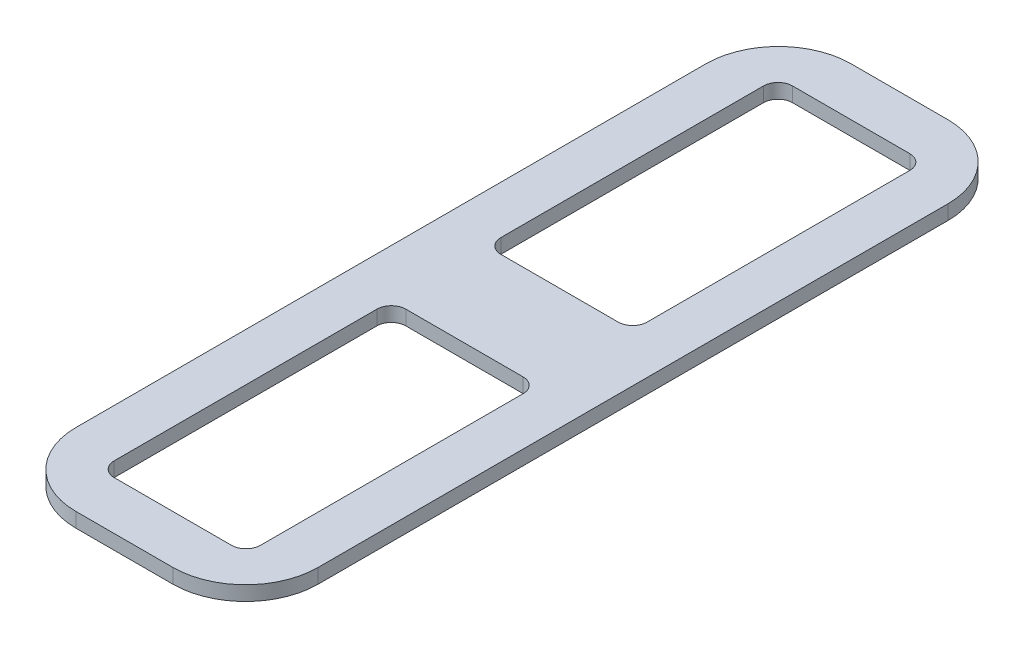
ISO-10303-21;
HEADER;
FILE_DESCRIPTION(('STEP AP214'),'2;1');
FILE_NAME('part.step','',(''),(''),'','','');
FILE_SCHEMA(('AUTOMOTIVE_DESIGN { 1 0 10303 214 1 1 1 1 }'));
ENDSEC;
DATA;
#1=APPLICATION_CONTEXT('core data for automotive mechanical design processes');
#2=APPLICATION_PROTOCOL_DEFINITION('international standard','automotive_design',2000,#1);
#3=PRODUCT_CONTEXT('',#1,'mechanical');
#4=PRODUCT('Part','Part','',(#3));
#5=PRODUCT_RELATED_PRODUCT_CATEGORY('part','',(#4));
#6=PRODUCT_DEFINITION_FORMATION('','',#4);
#7=PRODUCT_DEFINITION_CONTEXT('part definition',#1,'design');
#8=PRODUCT_DEFINITION('design','',#6,#7);
#9=PRODUCT_DEFINITION_SHAPE('','',#8);
#10=(LENGTH_UNIT() NAMED_UNIT(*) SI_UNIT(.MILLI.,.METRE.));
#11=(NAMED_UNIT(*) PLANE_ANGLE_UNIT() SI_UNIT($,.RADIAN.));
#12=(NAMED_UNIT(*) SI_UNIT($,.STERADIAN.) SOLID_ANGLE_UNIT());
#13=UNCERTAINTY_MEASURE_WITH_UNIT(LENGTH_MEASURE(1.E-05),#10,'distance_accuracy_value','');
#14=(GEOMETRIC_REPRESENTATION_CONTEXT(3) GLOBAL_UNCERTAINTY_ASSIGNED_CONTEXT((#13)) GLOBAL_UNIT_ASSIGNED_CONTEXT((#10,
#11,#12)) REPRESENTATION_CONTEXT('',''));
#15=CARTESIAN_POINT('',(0.,0.,0.));
#16=DIRECTION('',(0.,0.,1.));
#17=DIRECTION('',(1.,0.,0.));
#18=AXIS2_PLACEMENT_3D('',#15,#16,#17);
#19=CARTESIAN_POINT('',(0.,3.,0.));
#20=DIRECTION('',(0.,1.,0.));
#21=DIRECTION('',(0.,0.,1.));
#22=AXIS2_PLACEMENT_3D('',#19,#20,#21);
#23=PLANE('',#22);
#24=CARTESIAN_POINT('',(-12.1,3.,-67.));
#25=DIRECTION('',(0.,1.,0.));
#26=DIRECTION('',(0.,0.,1.));
#27=AXIS2_PLACEMENT_3D('',#24,#25,#26);
#28=CIRCLE('',#27,2.99999999999999);
#29=CARTESIAN_POINT('',(-12.1,3.,-70.));
#30=VERTEX_POINT('',#29);
#31=CARTESIAN_POINT('',(-15.1,3.,-67.));
#32=VERTEX_POINT('',#31);
#33=EDGE_CURVE('E277',#30,#32,#28,.T.);
#34=ORIENTED_EDGE('',*,*,#33,.F.);
#35=DIRECTION('',(1.,0.,0.));
#36=VECTOR('',#35,1.);
#37=CARTESIAN_POINT('',(-12.1,3.,-70.));
#38=LINE('',#37,#36);
#39=CARTESIAN_POINT('',(12.1,3.,-70.));
#40=VERTEX_POINT('',#39);
#41=EDGE_CURVE('E300',#30,#40,#38,.T.);
#42=ORIENTED_EDGE('',*,*,#41,.T.);
#43=CARTESIAN_POINT('',(12.1,3.,-67.));
#44=DIRECTION('',(0.,-1.,0.));
#45=DIRECTION('',(0.,0.,-1.));
#46=AXIS2_PLACEMENT_3D('',#43,#44,#45);
#47=CIRCLE('',#46,2.99999999999999);
#48=CARTESIAN_POINT('',(15.1,3.,-67.));
#49=VERTEX_POINT('',#48);
#50=EDGE_CURVE('E348',#40,#49,#47,.T.);
#51=ORIENTED_EDGE('',*,*,#50,.T.);
#52=DIRECTION('',(0.,0.,1.));
#53=VECTOR('',#52,1.);
#54=CARTESIAN_POINT('',(15.1,3.,-67.));
#55=LINE('',#54,#53);
#56=CARTESIAN_POINT('',(15.1,3.,-12.8));
#57=VERTEX_POINT('',#56);
#58=EDGE_CURVE('E344',#49,#57,#55,.T.);
#59=ORIENTED_EDGE('',*,*,#58,.T.);
#60=CARTESIAN_POINT('',(12.1,3.,-12.8));
#61=DIRECTION('',(0.,1.,0.));
#62=DIRECTION('',(0.,0.,1.));
#63=AXIS2_PLACEMENT_3D('',#60,#61,#62);
#64=CIRCLE('',#63,3.);
#65=CARTESIAN_POINT('',(12.1,3.,-9.8));
#66=VERTEX_POINT('',#65);
#67=EDGE_CURVE('E340',#66,#57,#64,.T.);
#68=ORIENTED_EDGE('',*,*,#67,.F.);
#69=DIRECTION('',(1.,0.,0.));
#70=VECTOR('',#69,1.);
#71=CARTESIAN_POINT('',(-12.1,3.,-9.8));
#72=LINE('',#71,#70);
#73=CARTESIAN_POINT('',(-12.1,3.,-9.8));
#74=VERTEX_POINT('',#73);
#75=EDGE_CURVE('E336',#74,#66,#72,.T.);
#76=ORIENTED_EDGE('',*,*,#75,.F.);
#77=CARTESIAN_POINT('',(-12.1,3.,-12.8));
#78=DIRECTION('',(0.,1.,0.));
#79=DIRECTION('',(0.,0.,1.));
#80=AXIS2_PLACEMENT_3D('',#77,#78,#79);
#81=CIRCLE('',#80,3.);
#82=CARTESIAN_POINT('',(-15.1,3.,-12.8));
#83=VERTEX_POINT('',#82);
#84=EDGE_CURVE('E332',#83,#74,#81,.T.);
#85=ORIENTED_EDGE('',*,*,#84,.F.);
#86=DIRECTION('',(0.,0.,1.));
#87=VECTOR('',#86,1.);
#88=CARTESIAN_POINT('',(-15.1,3.,-67.));
#89=LINE('',#88,#87);
#90=EDGE_CURVE('E328',#32,#83,#89,.T.);
#91=ORIENTED_EDGE('',*,*,#90,.F.);
#92=EDGE_LOOP('',(#34,#42,#51,#59,#68,#76,#85,#91));
#93=FACE_BOUND('',#92,.T.);
#94=DIRECTION('',(1.,0.,0.));
#95=VECTOR('',#94,1.);
#96=CARTESIAN_POINT('',(-25.,3.,80.));
#97=LINE('',#96,#95);
#98=CARTESIAN_POINT('',(-10.,3.,80.));
#99=VERTEX_POINT('',#98);
#100=CARTESIAN_POINT('',(9.99999999999999,3.,80.));
#101=VERTEX_POINT('',#100);
#102=EDGE_CURVE('E393',#99,#101,#97,.T.);
#103=ORIENTED_EDGE('',*,*,#102,.T.);
#104=CARTESIAN_POINT('',(10.,3.,65.));
#105=DIRECTION('',(0.,1.,0.));
#106=DIRECTION('',(0.,0.,1.));
#107=AXIS2_PLACEMENT_3D('',#104,#105,#106);
#108=CIRCLE('',#107,15.);
#109=CARTESIAN_POINT('',(25.,3.,65.));
#110=VERTEX_POINT('',#109);
#111=EDGE_CURVE('E446',#101,#110,#108,.T.);
#112=ORIENTED_EDGE('',*,*,#111,.T.);
#113=DIRECTION('',(0.,0.,-1.));
#114=VECTOR('',#113,1.);
#115=CARTESIAN_POINT('',(25.,3.,-80.));
#116=LINE('',#115,#114);
#117=CARTESIAN_POINT('',(25.,3.,-65.));
#118=VERTEX_POINT('',#117);
#119=EDGE_CURVE('E380',#110,#118,#116,.T.);
#120=ORIENTED_EDGE('',*,*,#119,.T.);
#121=CARTESIAN_POINT('',(9.99999999999999,3.,-65.));
#122=DIRECTION('',(0.,1.,0.));
#123=DIRECTION('',(0.,0.,1.));
#124=AXIS2_PLACEMENT_3D('',#121,#122,#123);
#125=CIRCLE('',#124,15.);
#126=CARTESIAN_POINT('',(9.99999999999999,3.,-80.));
#127=VERTEX_POINT('',#126);
#128=EDGE_CURVE('E440',#118,#127,#125,.T.);
#129=ORIENTED_EDGE('',*,*,#128,.T.);
#130=DIRECTION('',(-1.,0.,0.));
#131=VECTOR('',#130,1.);
#132=CARTESIAN_POINT('',(-25.,3.,-80.));
#133=LINE('',#132,#131);
#134=CARTESIAN_POINT('',(-10.,3.,-80.));
#135=VERTEX_POINT('',#134);
#136=EDGE_CURVE('E384',#127,#135,#133,.T.);
#137=ORIENTED_EDGE('',*,*,#136,.T.);
#138=CARTESIAN_POINT('',(-10.,3.,-65.));
#139=DIRECTION('',(0.,1.,0.));
#140=DIRECTION('',(0.,0.,1.));
#141=AXIS2_PLACEMENT_3D('',#138,#139,#140);
#142=CIRCLE('',#141,15.);
#143=CARTESIAN_POINT('',(-25.,3.,-65.));
#144=VERTEX_POINT('',#143);
#145=EDGE_CURVE('E437',#135,#144,#142,.T.);
#146=ORIENTED_EDGE('',*,*,#145,.T.);
#147=DIRECTION('',(0.,0.,1.));
#148=VECTOR('',#147,1.);
#149=CARTESIAN_POINT('',(-25.,3.,-80.));
#150=LINE('',#149,#148);
#151=CARTESIAN_POINT('',(-25.,3.,65.));
#152=VERTEX_POINT('',#151);
#153=EDGE_CURVE('E389',#144,#152,#150,.T.);
#154=ORIENTED_EDGE('',*,*,#153,.T.);
#155=CARTESIAN_POINT('',(-9.99999999999999,3.,65.));
#156=DIRECTION('',(0.,1.,0.));
#157=DIRECTION('',(0.,0.,1.));
#158=AXIS2_PLACEMENT_3D('',#155,#156,#157);
#159=CIRCLE('',#158,15.);
#160=EDGE_CURVE('E443',#152,#99,#159,.T.);
#161=ORIENTED_EDGE('',*,*,#160,.T.);
#162=EDGE_LOOP('',(#103,#112,#120,#129,#137,#146,#154,#161));
#163=FACE_BOUND('',#162,.T.);
#164=DIRECTION('',(1.,0.,0.));
#165=VECTOR('',#164,1.);
#166=CARTESIAN_POINT('',(-12.1,3.,70.));
#167=LINE('',#166,#165);
#168=CARTESIAN_POINT('',(-12.1,3.,70.));
#169=VERTEX_POINT('',#168);
#170=CARTESIAN_POINT('',(12.1,3.,70.));
#171=VERTEX_POINT('',#170);
#172=EDGE_CURVE('E252',#169,#171,#167,.T.);
#173=ORIENTED_EDGE('',*,*,#172,.F.);
#174=CARTESIAN_POINT('',(-12.1,3.,67.));
#175=DIRECTION('',(0.,-1.,0.));
#176=DIRECTION('',(0.,0.,-1.));
#177=AXIS2_PLACEMENT_3D('',#174,#175,#176);
#178=CIRCLE('',#177,2.99999999999999);
#179=CARTESIAN_POINT('',(-15.1,3.,67.));
#180=VERTEX_POINT('',#179);
#181=EDGE_CURVE('E59',#169,#180,#178,.T.);
#182=ORIENTED_EDGE('',*,*,#181,.T.);
#183=DIRECTION('',(0.,0.,-1.));
#184=VECTOR('',#183,1.);
#185=CARTESIAN_POINT('',(-15.1,3.,67.));
#186=LINE('',#185,#184);
#187=CARTESIAN_POINT('',(-15.1,3.,12.8));
#188=VERTEX_POINT('',#187);
#189=EDGE_CURVE('E226',#180,#188,#186,.T.);
#190=ORIENTED_EDGE('',*,*,#189,.T.);
#191=CARTESIAN_POINT('',(-12.1,3.,12.8));
#192=DIRECTION('',(0.,-1.,0.));
#193=DIRECTION('',(0.,0.,-1.));
#194=AXIS2_PLACEMENT_3D('',#191,#192,#193);
#195=CIRCLE('',#194,3.);
#196=CARTESIAN_POINT('',(-12.1,3.,9.8));
#197=VERTEX_POINT('',#196);
#198=EDGE_CURVE('E230',#188,#197,#195,.T.);
#199=ORIENTED_EDGE('',*,*,#198,.T.);
#200=DIRECTION('',(1.,0.,0.));
#201=VECTOR('',#200,1.);
#202=CARTESIAN_POINT('',(-12.1,3.,9.8));
#203=LINE('',#202,#201);
#204=CARTESIAN_POINT('',(12.1,3.,9.8));
#205=VERTEX_POINT('',#204);
#206=EDGE_CURVE('E267',#197,#205,#203,.T.);
#207=ORIENTED_EDGE('',*,*,#206,.T.);
#208=CARTESIAN_POINT('',(12.1,3.,12.8));
#209=DIRECTION('',(0.,-1.,0.));
#210=DIRECTION('',(0.,0.,-1.));
#211=AXIS2_PLACEMENT_3D('',#208,#209,#210);
#212=CIRCLE('',#211,3.);
#213=CARTESIAN_POINT('',(15.1,3.,12.8));
#214=VERTEX_POINT('',#213);
#215=EDGE_CURVE('E263',#205,#214,#212,.T.);
#216=ORIENTED_EDGE('',*,*,#215,.T.);
#217=DIRECTION('',(0.,0.,-1.));
#218=VECTOR('',#217,1.);
#219=CARTESIAN_POINT('',(15.1,3.,67.));
#220=LINE('',#219,#218);
#221=CARTESIAN_POINT('',(15.1,3.,67.));
#222=VERTEX_POINT('',#221);
#223=EDGE_CURVE('E259',#222,#214,#220,.T.);
#224=ORIENTED_EDGE('',*,*,#223,.F.);
#225=CARTESIAN_POINT('',(12.1,3.,67.));
#226=DIRECTION('',(0.,1.,0.));
#227=DIRECTION('',(0.,0.,1.));
#228=AXIS2_PLACEMENT_3D('',#225,#226,#227);
#229=CIRCLE('',#228,2.99999999999999);
#230=EDGE_CURVE('E255',#171,#222,#229,.T.);
#231=ORIENTED_EDGE('',*,*,#230,.F.);
#232=EDGE_LOOP('',(#173,#182,#190,#199,#207,#216,#224,#231));
#233=FACE_BOUND('',#232,.T.);
#234=ADVANCED_FACE('F43',(#93,#163,#233),#23,.T.);
#235=CARTESIAN_POINT('',(0.,0.,0.));
#236=DIRECTION('',(0.,1.,0.));
#237=DIRECTION('',(0.,0.,1.));
#238=AXIS2_PLACEMENT_3D('',#235,#236,#237);
#239=PLANE('',#238);
#240=DIRECTION('',(0.,0.,-1.));
#241=VECTOR('',#240,1.);
#242=CARTESIAN_POINT('',(25.,0.,-80.));
#243=LINE('',#242,#241);
#244=CARTESIAN_POINT('',(25.,0.,65.));
#245=VERTEX_POINT('',#244);
#246=CARTESIAN_POINT('',(25.,0.,-65.));
#247=VERTEX_POINT('',#246);
#248=EDGE_CURVE('E358',#245,#247,#243,.T.);
#249=ORIENTED_EDGE('',*,*,#248,.F.);
#250=CARTESIAN_POINT('',(10.,0.,65.));
#251=DIRECTION('',(0.,1.,0.));
#252=DIRECTION('',(0.,0.,1.));
#253=AXIS2_PLACEMENT_3D('',#250,#251,#252);
#254=CIRCLE('',#253,15.);
#255=CARTESIAN_POINT('',(9.99999999999999,0.,80.));
#256=VERTEX_POINT('',#255);
#257=EDGE_CURVE('E427',#245,#256,#254,.F.);
#258=ORIENTED_EDGE('',*,*,#257,.T.);
#259=DIRECTION('',(1.,0.,0.));
#260=VECTOR('',#259,1.);
#261=CARTESIAN_POINT('',(-25.,0.,80.));
#262=LINE('',#261,#260);
#263=CARTESIAN_POINT('',(-10.,0.,80.));
#264=VERTEX_POINT('',#263);
#265=EDGE_CURVE('E385',#264,#256,#262,.T.);
#266=ORIENTED_EDGE('',*,*,#265,.F.);
#267=CARTESIAN_POINT('',(-9.99999999999999,0.,65.));
#268=DIRECTION('',(0.,1.,0.));
#269=DIRECTION('',(0.,0.,1.));
#270=AXIS2_PLACEMENT_3D('',#267,#268,#269);
#271=CIRCLE('',#270,15.);
#272=CARTESIAN_POINT('',(-25.,0.,65.));
#273=VERTEX_POINT('',#272);
#274=EDGE_CURVE('E424',#264,#273,#271,.F.);
#275=ORIENTED_EDGE('',*,*,#274,.T.);
#276=DIRECTION('',(0.,0.,1.));
#277=VECTOR('',#276,1.);
#278=CARTESIAN_POINT('',(-25.,0.,-80.));
#279=LINE('',#278,#277);
#280=CARTESIAN_POINT('',(-25.,0.,-65.));
#281=VERTEX_POINT('',#280);
#282=EDGE_CURVE('E405',#281,#273,#279,.T.);
#283=ORIENTED_EDGE('',*,*,#282,.F.);
#284=CARTESIAN_POINT('',(-10.,0.,-65.));
#285=DIRECTION('',(0.,1.,0.));
#286=DIRECTION('',(0.,0.,1.));
#287=AXIS2_PLACEMENT_3D('',#284,#285,#286);
#288=CIRCLE('',#287,15.);
#289=CARTESIAN_POINT('',(-10.,0.,-80.));
#290=VERTEX_POINT('',#289);
#291=EDGE_CURVE('E418',#281,#290,#288,.F.);
#292=ORIENTED_EDGE('',*,*,#291,.T.);
#293=DIRECTION('',(-1.,0.,0.));
#294=VECTOR('',#293,1.);
#295=CARTESIAN_POINT('',(-25.,0.,-80.));
#296=LINE('',#295,#294);
#297=CARTESIAN_POINT('',(9.99999999999999,0.,-80.));
#298=VERTEX_POINT('',#297);
#299=EDGE_CURVE('E401',#298,#290,#296,.T.);
#300=ORIENTED_EDGE('',*,*,#299,.F.);
#301=CARTESIAN_POINT('',(9.99999999999999,0.,-65.));
#302=DIRECTION('',(0.,1.,0.));
#303=DIRECTION('',(0.,0.,1.));
#304=AXIS2_PLACEMENT_3D('',#301,#302,#303);
#305=CIRCLE('',#304,15.);
#306=EDGE_CURVE('E421',#298,#247,#305,.F.);
#307=ORIENTED_EDGE('',*,*,#306,.T.);
#308=EDGE_LOOP('',(#249,#258,#266,#275,#283,#292,#300,#307));
#309=FACE_BOUND('',#308,.T.);
#310=DIRECTION('',(1.,0.,0.));
#311=VECTOR('',#310,1.);
#312=CARTESIAN_POINT('',(-12.1,0.,-70.));
#313=LINE('',#312,#311);
#314=CARTESIAN_POINT('',(-12.1,0.,-70.));
#315=VERTEX_POINT('',#314);
#316=CARTESIAN_POINT('',(12.1,0.,-70.));
#317=VERTEX_POINT('',#316);
#318=EDGE_CURVE('E322',#315,#317,#313,.T.);
#319=ORIENTED_EDGE('',*,*,#318,.F.);
#320=CARTESIAN_POINT('',(-12.1,0.,-67.));
#321=DIRECTION('',(0.,1.,0.));
#322=DIRECTION('',(0.,0.,1.));
#323=AXIS2_PLACEMENT_3D('',#320,#321,#322);
#324=CIRCLE('',#323,2.99999999999999);
#325=CARTESIAN_POINT('',(-15.1,0.,-67.));
#326=VERTEX_POINT('',#325);
#327=EDGE_CURVE('E295',#315,#326,#324,.T.);
#328=ORIENTED_EDGE('',*,*,#327,.T.);
#329=DIRECTION('',(0.,0.,1.));
#330=VECTOR('',#329,1.);
#331=CARTESIAN_POINT('',(-15.1,0.,-67.));
#332=LINE('',#331,#330);
#333=CARTESIAN_POINT('',(-15.1,0.,-12.8));
#334=VERTEX_POINT('',#333);
#335=EDGE_CURVE('E299',#326,#334,#332,.T.);
#336=ORIENTED_EDGE('',*,*,#335,.T.);
#337=CARTESIAN_POINT('',(-12.1,0.,-12.8));
#338=DIRECTION('',(0.,1.,0.));
#339=DIRECTION('',(0.,0.,1.));
#340=AXIS2_PLACEMENT_3D('',#337,#338,#339);
#341=CIRCLE('',#340,3.);
#342=CARTESIAN_POINT('',(-12.1,0.,-9.8));
#343=VERTEX_POINT('',#342);
#344=EDGE_CURVE('E304',#334,#343,#341,.T.);
#345=ORIENTED_EDGE('',*,*,#344,.T.);
#346=DIRECTION('',(1.,0.,0.));
#347=VECTOR('',#346,1.);
#348=CARTESIAN_POINT('',(-12.1,0.,-9.8));
#349=LINE('',#348,#347);
#350=CARTESIAN_POINT('',(12.1,0.,-9.8));
#351=VERTEX_POINT('',#350);
#352=EDGE_CURVE('E308',#343,#351,#349,.T.);
#353=ORIENTED_EDGE('',*,*,#352,.T.);
#354=CARTESIAN_POINT('',(12.1,0.,-12.8));
#355=DIRECTION('',(0.,1.,0.));
#356=DIRECTION('',(0.,0.,1.));
#357=AXIS2_PLACEMENT_3D('',#354,#355,#356);
#358=CIRCLE('',#357,3.);
#359=CARTESIAN_POINT('',(15.1,0.,-12.8));
#360=VERTEX_POINT('',#359);
#361=EDGE_CURVE('E312',#351,#360,#358,.T.);
#362=ORIENTED_EDGE('',*,*,#361,.T.);
#363=DIRECTION('',(0.,0.,1.));
#364=VECTOR('',#363,1.);
#365=CARTESIAN_POINT('',(15.1,0.,-67.));
#366=LINE('',#365,#364);
#367=CARTESIAN_POINT('',(15.1,0.,-67.));
#368=VERTEX_POINT('',#367);
#369=EDGE_CURVE('E316',#368,#360,#366,.T.);
#370=ORIENTED_EDGE('',*,*,#369,.F.);
#371=CARTESIAN_POINT('',(12.1,0.,-67.));
#372=DIRECTION('',(0.,-1.,0.));
#373=DIRECTION('',(0.,0.,-1.));
#374=AXIS2_PLACEMENT_3D('',#371,#372,#373);
#375=CIRCLE('',#374,2.99999999999999);
#376=EDGE_CURVE('E319',#317,#368,#375,.T.);
#377=ORIENTED_EDGE('',*,*,#376,.F.);
#378=EDGE_LOOP('',(#319,#328,#336,#345,#353,#362,#370,#377));
#379=FACE_BOUND('',#378,.T.);
#380=CARTESIAN_POINT('',(-12.1,0.,67.));
#381=DIRECTION('',(0.,-1.,0.));
#382=DIRECTION('',(0.,0.,-1.));
#383=AXIS2_PLACEMENT_3D('',#380,#381,#382);
#384=CIRCLE('',#383,2.99999999999999);
#385=CARTESIAN_POINT('',(-12.1,0.,70.));
#386=VERTEX_POINT('',#385);
#387=CARTESIAN_POINT('',(-15.1,0.,67.));
#388=VERTEX_POINT('',#387);
#389=EDGE_CURVE('E207',#386,#388,#384,.T.);
#390=ORIENTED_EDGE('',*,*,#389,.F.);
#391=DIRECTION('',(1.,0.,0.));
#392=VECTOR('',#391,1.);
#393=CARTESIAN_POINT('',(-12.1,0.,70.));
#394=LINE('',#393,#392);
#395=CARTESIAN_POINT('',(12.1,0.,70.));
#396=VERTEX_POINT('',#395);
#397=EDGE_CURVE('E217',#386,#396,#394,.T.);
#398=ORIENTED_EDGE('',*,*,#397,.T.);
#399=CARTESIAN_POINT('',(12.1,0.,67.));
#400=DIRECTION('',(0.,1.,0.));
#401=DIRECTION('',(0.,0.,1.));
#402=AXIS2_PLACEMENT_3D('',#399,#400,#401);
#403=CIRCLE('',#402,2.99999999999999);
#404=CARTESIAN_POINT('',(15.1,0.,67.));
#405=VERTEX_POINT('',#404);
#406=EDGE_CURVE('E67',#396,#405,#403,.T.);
#407=ORIENTED_EDGE('',*,*,#406,.T.);
#408=DIRECTION('',(0.,0.,-1.));
#409=VECTOR('',#408,1.);
#410=CARTESIAN_POINT('',(15.1,0.,67.));
#411=LINE('',#410,#409);
#412=CARTESIAN_POINT('',(15.1,0.,12.8));
#413=VERTEX_POINT('',#412);
#414=EDGE_CURVE('E235',#405,#413,#411,.T.);
#415=ORIENTED_EDGE('',*,*,#414,.T.);
#416=CARTESIAN_POINT('',(12.1,0.,12.8));
#417=DIRECTION('',(0.,-1.,0.));
#418=DIRECTION('',(0.,0.,-1.));
#419=AXIS2_PLACEMENT_3D('',#416,#417,#418);
#420=CIRCLE('',#419,3.);
#421=CARTESIAN_POINT('',(12.1,0.,9.8));
#422=VERTEX_POINT('',#421);
#423=EDGE_CURVE('E239',#422,#413,#420,.T.);
#424=ORIENTED_EDGE('',*,*,#423,.F.);
#425=DIRECTION('',(1.,0.,0.));
#426=VECTOR('',#425,1.);
#427=CARTESIAN_POINT('',(-12.1,0.,9.8));
#428=LINE('',#427,#426);
#429=CARTESIAN_POINT('',(-12.1,0.,9.8));
#430=VERTEX_POINT('',#429);
#431=EDGE_CURVE('E242',#430,#422,#428,.T.);
#432=ORIENTED_EDGE('',*,*,#431,.F.);
#433=CARTESIAN_POINT('',(-12.1,0.,12.8));
#434=DIRECTION('',(0.,-1.,0.));
#435=DIRECTION('',(0.,0.,-1.));
#436=AXIS2_PLACEMENT_3D('',#433,#434,#435);
#437=CIRCLE('',#436,3.);
#438=CARTESIAN_POINT('',(-15.1,0.,12.8));
#439=VERTEX_POINT('',#438);
#440=EDGE_CURVE('E245',#439,#430,#437,.T.);
#441=ORIENTED_EDGE('',*,*,#440,.F.);
#442=DIRECTION('',(0.,0.,-1.));
#443=VECTOR('',#442,1.);
#444=CARTESIAN_POINT('',(-15.1,0.,67.));
#445=LINE('',#444,#443);
#446=EDGE_CURVE('E214',#388,#439,#445,.T.);
#447=ORIENTED_EDGE('',*,*,#446,.F.);
#448=EDGE_LOOP('',(#390,#398,#407,#415,#424,#432,#441,#447));
#449=FACE_BOUND('',#448,.T.);
#450=ADVANCED_FACE('F223',(#309,#379,#449),#239,.F.);
#451=CARTESIAN_POINT('',(25.,3.,-80.));
#452=DIRECTION('',(-1.,0.,0.));
#453=DIRECTION('',(0.,0.,1.));
#454=AXIS2_PLACEMENT_3D('',#451,#452,#453);
#455=PLANE('',#454);
#456=ORIENTED_EDGE('',*,*,#119,.F.);
#457=DIRECTION('',(0.,-1.,0.));
#458=VECTOR('',#457,1.);
#459=CARTESIAN_POINT('',(25.,3.,65.));
#460=LINE('',#459,#458);
#461=EDGE_CURVE('E414',#110,#245,#460,.T.);
#462=ORIENTED_EDGE('',*,*,#461,.T.);
#463=ORIENTED_EDGE('',*,*,#248,.T.);
#464=DIRECTION('',(0.,-1.,0.));
#465=VECTOR('',#464,1.);
#466=CARTESIAN_POINT('',(25.,3.,-65.));
#467=LINE('',#466,#465);
#468=EDGE_CURVE('E397',#247,#118,#467,.F.);
#469=ORIENTED_EDGE('',*,*,#468,.T.);
#470=EDGE_LOOP('',(#456,#462,#463,#469));
#471=FACE_BOUND('',#470,.T.);
#472=ADVANCED_FACE('F491',(#471),#455,.F.);
#473=CARTESIAN_POINT('',(-25.,3.,-80.));
#474=DIRECTION('',(0.,0.,1.));
#475=DIRECTION('',(1.,0.,0.));
#476=AXIS2_PLACEMENT_3D('',#473,#474,#475);
#477=PLANE('',#476);
#478=ORIENTED_EDGE('',*,*,#136,.F.);
#479=DIRECTION('',(0.,-1.,0.));
#480=VECTOR('',#479,1.);
#481=CARTESIAN_POINT('',(9.99999999999999,3.,-80.));
#482=LINE('',#481,#480);
#483=EDGE_CURVE('E11',#127,#298,#482,.T.);
#484=ORIENTED_EDGE('',*,*,#483,.T.);
#485=ORIENTED_EDGE('',*,*,#299,.T.);
#486=DIRECTION('',(0.,-1.,0.));
#487=VECTOR('',#486,1.);
#488=CARTESIAN_POINT('',(-10.,3.,-80.));
#489=LINE('',#488,#487);
#490=EDGE_CURVE('E52',#290,#135,#489,.F.);
#491=ORIENTED_EDGE('',*,*,#490,.T.);
#492=EDGE_LOOP('',(#478,#484,#485,#491));
#493=FACE_BOUND('',#492,.T.);
#494=ADVANCED_FACE('F459',(#493),#477,.F.);
#495=CARTESIAN_POINT('',(-25.,3.,-80.));
#496=DIRECTION('',(1.,0.,0.));
#497=DIRECTION('',(0.,0.,-1.));
#498=AXIS2_PLACEMENT_3D('',#495,#496,#497);
#499=PLANE('',#498);
#500=ORIENTED_EDGE('',*,*,#282,.T.);
#501=DIRECTION('',(0.,-1.,0.));
#502=VECTOR('',#501,1.);
#503=CARTESIAN_POINT('',(-25.,3.,65.));
#504=LINE('',#503,#502);
#505=EDGE_CURVE('E453',#273,#152,#504,.F.);
#506=ORIENTED_EDGE('',*,*,#505,.T.);
#507=ORIENTED_EDGE('',*,*,#153,.F.);
#508=DIRECTION('',(0.,-1.,0.));
#509=VECTOR('',#508,1.);
#510=CARTESIAN_POINT('',(-25.,3.,-65.));
#511=LINE('',#510,#509);
#512=EDGE_CURVE('E449',#144,#281,#511,.T.);
#513=ORIENTED_EDGE('',*,*,#512,.T.);
#514=EDGE_LOOP('',(#500,#506,#507,#513));
#515=FACE_BOUND('',#514,.T.);
#516=ADVANCED_FACE('F471',(#515),#499,.F.);
#517=CARTESIAN_POINT('',(-25.,3.,80.));
#518=DIRECTION('',(0.,0.,-1.));
#519=DIRECTION('',(-1.,0.,0.));
#520=AXIS2_PLACEMENT_3D('',#517,#518,#519);
#521=PLANE('',#520);
#522=ORIENTED_EDGE('',*,*,#265,.T.);
#523=DIRECTION('',(0.,-1.,0.));
#524=VECTOR('',#523,1.);
#525=CARTESIAN_POINT('',(10.,3.,80.));
#526=LINE('',#525,#524);
#527=EDGE_CURVE('E434',#256,#101,#526,.F.);
#528=ORIENTED_EDGE('',*,*,#527,.T.);
#529=ORIENTED_EDGE('',*,*,#102,.F.);
#530=DIRECTION('',(0.,-1.,0.));
#531=VECTOR('',#530,1.);
#532=CARTESIAN_POINT('',(-9.99999999999999,3.,80.));
#533=LINE('',#532,#531);
#534=EDGE_CURVE('E430',#99,#264,#533,.T.);
#535=ORIENTED_EDGE('',*,*,#534,.T.);
#536=EDGE_LOOP('',(#522,#528,#529,#535));
#537=FACE_BOUND('',#536,.T.);
#538=ADVANCED_FACE('F483',(#537),#521,.F.);
#539=CARTESIAN_POINT('',(10.,3.,65.));
#540=DIRECTION('',(0.,-1.,0.));
#541=DIRECTION('',(0.,0.,-1.));
#542=AXIS2_PLACEMENT_3D('',#539,#540,#541);
#543=CYLINDRICAL_SURFACE('',#542,15.);
#544=ORIENTED_EDGE('',*,*,#111,.F.);
#545=ORIENTED_EDGE('',*,*,#527,.F.);
#546=ORIENTED_EDGE('',*,*,#257,.F.);
#547=ORIENTED_EDGE('',*,*,#461,.F.);
#548=EDGE_LOOP('',(#544,#545,#546,#547));
#549=FACE_BOUND('',#548,.T.);
#550=ADVANCED_FACE('F489',(#549),#543,.T.);
#551=CARTESIAN_POINT('',(-9.99999999999999,3.,65.));
#552=DIRECTION('',(0.,-1.,0.));
#553=DIRECTION('',(0.,0.,-1.));
#554=AXIS2_PLACEMENT_3D('',#551,#552,#553);
#555=CYLINDRICAL_SURFACE('',#554,15.);
#556=ORIENTED_EDGE('',*,*,#160,.F.);
#557=ORIENTED_EDGE('',*,*,#505,.F.);
#558=ORIENTED_EDGE('',*,*,#274,.F.);
#559=ORIENTED_EDGE('',*,*,#534,.F.);
#560=EDGE_LOOP('',(#556,#557,#558,#559));
#561=FACE_BOUND('',#560,.T.);
#562=ADVANCED_FACE('F480',(#561),#555,.T.);
#563=CARTESIAN_POINT('',(9.99999999999999,3.,-65.));
#564=DIRECTION('',(0.,-1.,0.));
#565=DIRECTION('',(0.,0.,-1.));
#566=AXIS2_PLACEMENT_3D('',#563,#564,#565);
#567=CYLINDRICAL_SURFACE('',#566,15.);
#568=ORIENTED_EDGE('',*,*,#128,.F.);
#569=ORIENTED_EDGE('',*,*,#468,.F.);
#570=ORIENTED_EDGE('',*,*,#306,.F.);
#571=ORIENTED_EDGE('',*,*,#483,.F.);
#572=EDGE_LOOP('',(#568,#569,#570,#571));
#573=FACE_BOUND('',#572,.T.);
#574=ADVANCED_FACE('F494',(#573),#567,.T.);
#575=CARTESIAN_POINT('',(-10.,3.,-65.));
#576=DIRECTION('',(0.,-1.,0.));
#577=DIRECTION('',(0.,0.,-1.));
#578=AXIS2_PLACEMENT_3D('',#575,#576,#577);
#579=CYLINDRICAL_SURFACE('',#578,15.);
#580=ORIENTED_EDGE('',*,*,#145,.F.);
#581=ORIENTED_EDGE('',*,*,#490,.F.);
#582=ORIENTED_EDGE('',*,*,#291,.F.);
#583=ORIENTED_EDGE('',*,*,#512,.F.);
#584=EDGE_LOOP('',(#580,#581,#582,#583));
#585=FACE_BOUND('',#584,.T.);
#586=ADVANCED_FACE('F45',(#585),#579,.T.);
#587=CARTESIAN_POINT('',(-12.1,0.,-67.));
#588=DIRECTION('',(0.,1.,0.));
#589=DIRECTION('',(0.,0.,1.));
#590=AXIS2_PLACEMENT_3D('',#587,#588,#589);
#591=CYLINDRICAL_SURFACE('',#590,2.99999999999999);
#592=ORIENTED_EDGE('',*,*,#33,.T.);
#593=DIRECTION('',(0.,1.,0.));
#594=VECTOR('',#593,1.);
#595=CARTESIAN_POINT('',(-15.1,0.,-67.));
#596=LINE('',#595,#594);
#597=EDGE_CURVE('E325',#326,#32,#596,.T.);
#598=ORIENTED_EDGE('',*,*,#597,.F.);
#599=ORIENTED_EDGE('',*,*,#327,.F.);
#600=DIRECTION('',(0.,1.,0.));
#601=VECTOR('',#600,1.);
#602=CARTESIAN_POINT('',(-12.1,0.,-70.));
#603=LINE('',#602,#601);
#604=EDGE_CURVE('E355',#315,#30,#603,.T.);
#605=ORIENTED_EDGE('',*,*,#604,.T.);
#606=EDGE_LOOP('',(#592,#598,#599,#605));
#607=FACE_BOUND('',#606,.T.);
#608=ADVANCED_FACE('F500',(#607),#591,.F.);
#609=CARTESIAN_POINT('',(-12.1,0.,-70.));
#610=DIRECTION('',(0.,0.,1.));
#611=DIRECTION('',(1.,0.,0.));
#612=AXIS2_PLACEMENT_3D('',#609,#610,#611);
#613=PLANE('',#612);
#614=ORIENTED_EDGE('',*,*,#41,.F.);
#615=ORIENTED_EDGE('',*,*,#604,.F.);
#616=ORIENTED_EDGE('',*,*,#318,.T.);
#617=DIRECTION('',(0.,1.,0.));
#618=VECTOR('',#617,1.);
#619=CARTESIAN_POINT('',(12.1,0.,-70.));
#620=LINE('',#619,#618);
#621=EDGE_CURVE('E359',#317,#40,#620,.T.);
#622=ORIENTED_EDGE('',*,*,#621,.T.);
#623=EDGE_LOOP('',(#614,#615,#616,#622));
#624=FACE_BOUND('',#623,.T.);
#625=ADVANCED_FACE('F552',(#624),#613,.T.);
#626=CARTESIAN_POINT('',(12.1,0.,-67.));
#627=DIRECTION('',(0.,1.,0.));
#628=DIRECTION('',(0.,0.,1.));
#629=AXIS2_PLACEMENT_3D('',#626,#627,#628);
#630=CYLINDRICAL_SURFACE('',#629,2.99999999999999);
#631=ORIENTED_EDGE('',*,*,#50,.F.);
#632=ORIENTED_EDGE('',*,*,#621,.F.);
#633=ORIENTED_EDGE('',*,*,#376,.T.);
#634=DIRECTION('',(0.,1.,0.));
#635=VECTOR('',#634,1.);
#636=CARTESIAN_POINT('',(15.1,0.,-67.));
#637=LINE('',#636,#635);
#638=EDGE_CURVE('E362',#368,#49,#637,.T.);
#639=ORIENTED_EDGE('',*,*,#638,.T.);
#640=EDGE_LOOP('',(#631,#632,#633,#639));
#641=FACE_BOUND('',#640,.T.);
#642=ADVANCED_FACE('F562',(#641),#630,.F.);
#643=CARTESIAN_POINT('',(15.1,0.,-67.));
#644=DIRECTION('',(-1.,0.,0.));
#645=DIRECTION('',(0.,0.,1.));
#646=AXIS2_PLACEMENT_3D('',#643,#644,#645);
#647=PLANE('',#646);
#648=ORIENTED_EDGE('',*,*,#58,.F.);
#649=ORIENTED_EDGE('',*,*,#638,.F.);
#650=ORIENTED_EDGE('',*,*,#369,.T.);
#651=DIRECTION('',(0.,1.,0.));
#652=VECTOR('',#651,1.);
#653=CARTESIAN_POINT('',(15.1,0.,-12.8));
#654=LINE('',#653,#652);
#655=EDGE_CURVE('E365',#360,#57,#654,.T.);
#656=ORIENTED_EDGE('',*,*,#655,.T.);
#657=EDGE_LOOP('',(#648,#649,#650,#656));
#658=FACE_BOUND('',#657,.T.);
#659=ADVANCED_FACE('F573',(#658),#647,.T.);
#660=CARTESIAN_POINT('',(12.1,0.,-12.8));
#661=DIRECTION('',(0.,1.,0.));
#662=DIRECTION('',(0.,0.,1.));
#663=AXIS2_PLACEMENT_3D('',#660,#661,#662);
#664=CYLINDRICAL_SURFACE('',#663,3.);
#665=ORIENTED_EDGE('',*,*,#67,.T.);
#666=ORIENTED_EDGE('',*,*,#655,.F.);
#667=ORIENTED_EDGE('',*,*,#361,.F.);
#668=DIRECTION('',(0.,1.,0.));
#669=VECTOR('',#668,1.);
#670=CARTESIAN_POINT('',(12.1,0.,-9.8));
#671=LINE('',#670,#669);
#672=EDGE_CURVE('E368',#351,#66,#671,.T.);
#673=ORIENTED_EDGE('',*,*,#672,.T.);
#674=EDGE_LOOP('',(#665,#666,#667,#673));
#675=FACE_BOUND('',#674,.T.);
#676=ADVANCED_FACE('F584',(#675),#664,.F.);
#677=CARTESIAN_POINT('',(-12.1,0.,-9.8));
#678=DIRECTION('',(0.,0.,1.));
#679=DIRECTION('',(1.,0.,0.));
#680=AXIS2_PLACEMENT_3D('',#677,#678,#679);
#681=PLANE('',#680);
#682=ORIENTED_EDGE('',*,*,#75,.T.);
#683=ORIENTED_EDGE('',*,*,#672,.F.);
#684=ORIENTED_EDGE('',*,*,#352,.F.);
#685=DIRECTION('',(0.,1.,0.));
#686=VECTOR('',#685,1.);
#687=CARTESIAN_POINT('',(-12.1,0.,-9.8));
#688=LINE('',#687,#686);
#689=EDGE_CURVE('E371',#343,#74,#688,.T.);
#690=ORIENTED_EDGE('',*,*,#689,.T.);
#691=EDGE_LOOP('',(#682,#683,#684,#690));
#692=FACE_BOUND('',#691,.T.);
#693=ADVANCED_FACE('F595',(#692),#681,.F.);
#694=CARTESIAN_POINT('',(-12.1,0.,-12.8));
#695=DIRECTION('',(0.,1.,0.));
#696=DIRECTION('',(0.,0.,1.));
#697=AXIS2_PLACEMENT_3D('',#694,#695,#696);
#698=CYLINDRICAL_SURFACE('',#697,3.);
#699=ORIENTED_EDGE('',*,*,#84,.T.);
#700=ORIENTED_EDGE('',*,*,#689,.F.);
#701=ORIENTED_EDGE('',*,*,#344,.F.);
#702=DIRECTION('',(0.,1.,0.));
#703=VECTOR('',#702,1.);
#704=CARTESIAN_POINT('',(-15.1,0.,-12.8));
#705=LINE('',#704,#703);
#706=EDGE_CURVE('E374',#334,#83,#705,.T.);
#707=ORIENTED_EDGE('',*,*,#706,.T.);
#708=EDGE_LOOP('',(#699,#700,#701,#707));
#709=FACE_BOUND('',#708,.T.);
#710=ADVANCED_FACE('F606',(#709),#698,.F.);
#711=CARTESIAN_POINT('',(-15.1,0.,-67.));
#712=DIRECTION('',(-1.,0.,0.));
#713=DIRECTION('',(0.,0.,1.));
#714=AXIS2_PLACEMENT_3D('',#711,#712,#713);
#715=PLANE('',#714);
#716=ORIENTED_EDGE('',*,*,#90,.T.);
#717=ORIENTED_EDGE('',*,*,#706,.F.);
#718=ORIENTED_EDGE('',*,*,#335,.F.);
#719=ORIENTED_EDGE('',*,*,#597,.T.);
#720=EDGE_LOOP('',(#716,#717,#718,#719));
#721=FACE_BOUND('',#720,.T.);
#722=ADVANCED_FACE('F617',(#721),#715,.F.);
#723=CARTESIAN_POINT('',(-12.1,0.,67.));
#724=DIRECTION('',(0.,1.,0.));
#725=DIRECTION('',(0.,0.,1.));
#726=AXIS2_PLACEMENT_3D('',#723,#724,#725);
#727=CYLINDRICAL_SURFACE('',#726,2.99999999999999);
#728=ORIENTED_EDGE('',*,*,#181,.F.);
#729=DIRECTION('',(0.,1.,0.));
#730=VECTOR('',#729,1.);
#731=CARTESIAN_POINT('',(-12.1,0.,70.));
#732=LINE('',#731,#730);
#733=EDGE_CURVE('E203',#386,#169,#732,.T.);
#734=ORIENTED_EDGE('',*,*,#733,.F.);
#735=ORIENTED_EDGE('',*,*,#389,.T.);
#736=DIRECTION('',(0.,1.,0.));
#737=VECTOR('',#736,1.);
#738=CARTESIAN_POINT('',(-15.1,0.,67.));
#739=LINE('',#738,#737);
#740=EDGE_CURVE('E274',#388,#180,#739,.T.);
#741=ORIENTED_EDGE('',*,*,#740,.T.);
#742=EDGE_LOOP('',(#728,#734,#735,#741));
#743=FACE_BOUND('',#742,.T.);
#744=ADVANCED_FACE('F205',(#743),#727,.F.);
#745=CARTESIAN_POINT('',(-15.1,0.,67.));
#746=DIRECTION('',(1.,0.,0.));
#747=DIRECTION('',(0.,0.,-1.));
#748=AXIS2_PLACEMENT_3D('',#745,#746,#747);
#749=PLANE('',#748);
#750=ORIENTED_EDGE('',*,*,#189,.F.);
#751=ORIENTED_EDGE('',*,*,#740,.F.);
#752=ORIENTED_EDGE('',*,*,#446,.T.);
#753=DIRECTION('',(0.,1.,0.));
#754=VECTOR('',#753,1.);
#755=CARTESIAN_POINT('',(-15.1,0.,12.8));
#756=LINE('',#755,#754);
#757=EDGE_CURVE('E278',#439,#188,#756,.T.);
#758=ORIENTED_EDGE('',*,*,#757,.T.);
#759=EDGE_LOOP('',(#750,#751,#752,#758));
#760=FACE_BOUND('',#759,.T.);
#761=ADVANCED_FACE('F648',(#760),#749,.T.);
#762=CARTESIAN_POINT('',(-12.1,0.,12.8));
#763=DIRECTION('',(0.,1.,0.));
#764=DIRECTION('',(0.,0.,1.));
#765=AXIS2_PLACEMENT_3D('',#762,#763,#764);
#766=CYLINDRICAL_SURFACE('',#765,3.);
#767=ORIENTED_EDGE('',*,*,#198,.F.);
#768=ORIENTED_EDGE('',*,*,#757,.F.);
#769=ORIENTED_EDGE('',*,*,#440,.T.);
#770=DIRECTION('',(0.,1.,0.));
#771=VECTOR('',#770,1.);
#772=CARTESIAN_POINT('',(-12.1,0.,9.8));
#773=LINE('',#772,#771);
#774=EDGE_CURVE('E281',#430,#197,#773,.T.);
#775=ORIENTED_EDGE('',*,*,#774,.T.);
#776=EDGE_LOOP('',(#767,#768,#769,#775));
#777=FACE_BOUND('',#776,.T.);
#778=ADVANCED_FACE('F657',(#777),#766,.F.);
#779=CARTESIAN_POINT('',(-12.1,0.,9.8));
#780=DIRECTION('',(0.,0.,1.));
#781=DIRECTION('',(1.,0.,0.));
#782=AXIS2_PLACEMENT_3D('',#779,#780,#781);
#783=PLANE('',#782);
#784=ORIENTED_EDGE('',*,*,#206,.F.);
#785=ORIENTED_EDGE('',*,*,#774,.F.);
#786=ORIENTED_EDGE('',*,*,#431,.T.);
#787=DIRECTION('',(0.,1.,0.));
#788=VECTOR('',#787,1.);
#789=CARTESIAN_POINT('',(12.1,0.,9.8));
#790=LINE('',#789,#788);
#791=EDGE_CURVE('E284',#422,#205,#790,.T.);
#792=ORIENTED_EDGE('',*,*,#791,.T.);
#793=EDGE_LOOP('',(#784,#785,#786,#792));
#794=FACE_BOUND('',#793,.T.);
#795=ADVANCED_FACE('F668',(#794),#783,.T.);
#796=CARTESIAN_POINT('',(12.1,0.,12.8));
#797=DIRECTION('',(0.,1.,0.));
#798=DIRECTION('',(0.,0.,1.));
#799=AXIS2_PLACEMENT_3D('',#796,#797,#798);
#800=CYLINDRICAL_SURFACE('',#799,3.);
#801=ORIENTED_EDGE('',*,*,#215,.F.);
#802=ORIENTED_EDGE('',*,*,#791,.F.);
#803=ORIENTED_EDGE('',*,*,#423,.T.);
#804=DIRECTION('',(0.,1.,0.));
#805=VECTOR('',#804,1.);
#806=CARTESIAN_POINT('',(15.1,0.,12.8));
#807=LINE('',#806,#805);
#808=EDGE_CURVE('E287',#413,#214,#807,.T.);
#809=ORIENTED_EDGE('',*,*,#808,.T.);
#810=EDGE_LOOP('',(#801,#802,#803,#809));
#811=FACE_BOUND('',#810,.T.);
#812=ADVANCED_FACE('F679',(#811),#800,.F.);
#813=CARTESIAN_POINT('',(15.1,0.,67.));
#814=DIRECTION('',(1.,0.,0.));
#815=DIRECTION('',(0.,0.,-1.));
#816=AXIS2_PLACEMENT_3D('',#813,#814,#815);
#817=PLANE('',#816);
#818=ORIENTED_EDGE('',*,*,#223,.T.);
#819=ORIENTED_EDGE('',*,*,#808,.F.);
#820=ORIENTED_EDGE('',*,*,#414,.F.);
#821=DIRECTION('',(0.,1.,0.));
#822=VECTOR('',#821,1.);
#823=CARTESIAN_POINT('',(15.1,0.,67.));
#824=LINE('',#823,#822);
#825=EDGE_CURVE('E290',#405,#222,#824,.T.);
#826=ORIENTED_EDGE('',*,*,#825,.T.);
#827=EDGE_LOOP('',(#818,#819,#820,#826));
#828=FACE_BOUND('',#827,.T.);
#829=ADVANCED_FACE('F690',(#828),#817,.F.);
#830=CARTESIAN_POINT('',(12.1,0.,67.));
#831=DIRECTION('',(0.,1.,0.));
#832=DIRECTION('',(0.,0.,1.));
#833=AXIS2_PLACEMENT_3D('',#830,#831,#832);
#834=CYLINDRICAL_SURFACE('',#833,2.99999999999999);
#835=ORIENTED_EDGE('',*,*,#230,.T.);
#836=ORIENTED_EDGE('',*,*,#825,.F.);
#837=ORIENTED_EDGE('',*,*,#406,.F.);
#838=DIRECTION('',(0.,1.,0.));
#839=VECTOR('',#838,1.);
#840=CARTESIAN_POINT('',(12.1,0.,70.));
#841=LINE('',#840,#839);
#842=EDGE_CURVE('E213',#396,#171,#841,.T.);
#843=ORIENTED_EDGE('',*,*,#842,.T.);
#844=EDGE_LOOP('',(#835,#836,#837,#843));
#845=FACE_BOUND('',#844,.T.);
#846=ADVANCED_FACE('F701',(#845),#834,.F.);
#847=CARTESIAN_POINT('',(-12.1,0.,70.));
#848=DIRECTION('',(0.,0.,1.));
#849=DIRECTION('',(1.,0.,0.));
#850=AXIS2_PLACEMENT_3D('',#847,#848,#849);
#851=PLANE('',#850);
#852=ORIENTED_EDGE('',*,*,#172,.T.);
#853=ORIENTED_EDGE('',*,*,#842,.F.);
#854=ORIENTED_EDGE('',*,*,#397,.F.);
#855=ORIENTED_EDGE('',*,*,#733,.T.);
#856=EDGE_LOOP('',(#852,#853,#854,#855));
#857=FACE_BOUND('',#856,.T.);
#858=ADVANCED_FACE('F218',(#857),#851,.F.);
#859=CLOSED_SHELL('',(#234,#450,#472,#494,#516,#538,#550,#562,#574,#586,#608,#625,#642,#659,
#676,#693,#710,#722,#744,#761,#778,#795,#812,#829,#846,#858));
#860=MANIFOLD_SOLID_BREP('B2',#859);
#861=ADVANCED_BREP_SHAPE_REPRESENTATION('',(#18,#860),#14);
#862=SHAPE_DEFINITION_REPRESENTATION(#9,#861);
ENDSEC;
END-ISO-10303-21;
